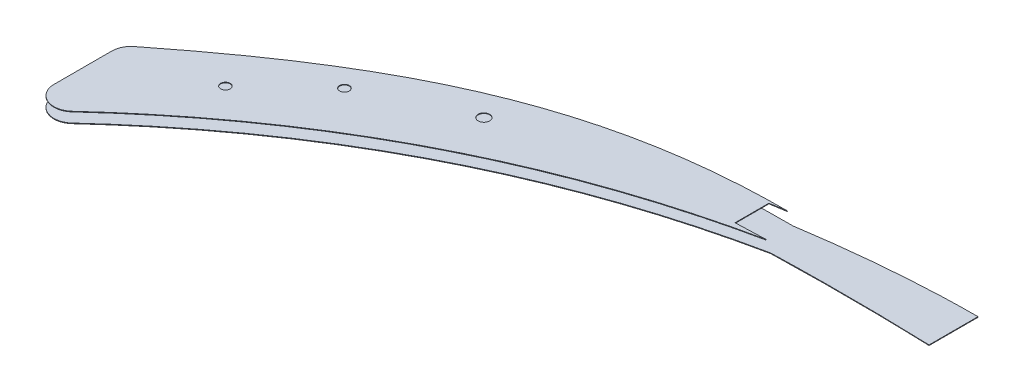
ISO-10303-21;
HEADER;
FILE_DESCRIPTION(('STEP AP214'),'2;1');
FILE_NAME('part.step','',(''),(''),'','','');
FILE_SCHEMA(('AUTOMOTIVE_DESIGN { 1 0 10303 214 1 1 1 1 }'));
ENDSEC;
DATA;
#1=APPLICATION_CONTEXT('core data for automotive mechanical design processes');
#2=APPLICATION_PROTOCOL_DEFINITION('international standard','automotive_design',2000,#1);
#3=PRODUCT_CONTEXT('',#1,'mechanical');
#4=PRODUCT('Part','Part','',(#3));
#5=PRODUCT_RELATED_PRODUCT_CATEGORY('part','',(#4));
#6=PRODUCT_DEFINITION_FORMATION('','',#4);
#7=PRODUCT_DEFINITION_CONTEXT('part definition',#1,'design');
#8=PRODUCT_DEFINITION('design','',#6,#7);
#9=PRODUCT_DEFINITION_SHAPE('','',#8);
#10=(LENGTH_UNIT() NAMED_UNIT(*) SI_UNIT(.MILLI.,.METRE.));
#11=(NAMED_UNIT(*) PLANE_ANGLE_UNIT() SI_UNIT($,.RADIAN.));
#12=(NAMED_UNIT(*) SI_UNIT($,.STERADIAN.) SOLID_ANGLE_UNIT());
#13=UNCERTAINTY_MEASURE_WITH_UNIT(LENGTH_MEASURE(1.E-05),#10,'distance_accuracy_value','');
#14=(GEOMETRIC_REPRESENTATION_CONTEXT(3) GLOBAL_UNCERTAINTY_ASSIGNED_CONTEXT((#13)) GLOBAL_UNIT_ASSIGNED_CONTEXT((#10,
#11,#12)) REPRESENTATION_CONTEXT('',''));
#15=CARTESIAN_POINT('',(0.,0.,0.));
#16=DIRECTION('',(0.,0.,1.));
#17=DIRECTION('',(1.,0.,0.));
#18=AXIS2_PLACEMENT_3D('',#15,#16,#17);
#19=CARTESIAN_POINT('',(-399.451682503824,300.3,386.496425626492));
#20=CARTESIAN_POINT('',(-331.649658003381,300.3,324.043622454853));
#21=CARTESIAN_POINT('',(-251.845093079777,300.3,282.915553356741));
#22=CARTESIAN_POINT('',(-161.60969154118,300.3,263.964054369405));
#23=B_SPLINE_CURVE_WITH_KNOTS('',3,(#19,#20,#21,#22),.UNSPECIFIED.,.F.,.F.,(4,4),(0.,
0.857945261881802),.UNSPECIFIED.);
#24=DIRECTION('',(0.,-1.,0.));
#25=VECTOR('',#24,1.);
#26=SURFACE_OF_LINEAR_EXTRUSION('',#23,#25);
#27=CARTESIAN_POINT('',(-399.451682503824,300.,386.496425626492));
#28=CARTESIAN_POINT('',(-331.649658003381,300.,324.043622454853));
#29=CARTESIAN_POINT('',(-251.845093079777,300.,282.915553356741));
#30=CARTESIAN_POINT('',(-161.60969154118,300.,263.964054369405));
#31=B_SPLINE_CURVE_WITH_KNOTS('',3,(#27,#28,#29,#30),.UNSPECIFIED.,.F.,.F.,(4,4),(0.,
0.857945261881802),.UNSPECIFIED.);
#32=CARTESIAN_POINT('',(-399.451682503824,300.,386.496425626493));
#33=VERTEX_POINT('',#32);
#34=CARTESIAN_POINT('',(-161.609691541186,300.,263.964054369406));
#35=VERTEX_POINT('',#34);
#36=EDGE_CURVE('E254',#33,#35,#31,.T.);
#37=ORIENTED_EDGE('',*,*,#36,.T.);
#38=DIRECTION('',(0.,-1.,0.));
#39=VECTOR('',#38,1.);
#40=CARTESIAN_POINT('',(-161.609691541186,300.3,263.964054369406));
#41=LINE('',#40,#39);
#42=CARTESIAN_POINT('',(-161.609691541186,300.3,263.964054369406));
#43=VERTEX_POINT('',#42);
#44=EDGE_CURVE('E12',#43,#35,#41,.T.);
#45=ORIENTED_EDGE('',*,*,#44,.F.);
#46=CARTESIAN_POINT('',(-161.60969154118,300.3,263.964054369405));
#47=CARTESIAN_POINT('',(-251.845093079777,300.3,282.915553356741));
#48=CARTESIAN_POINT('',(-331.649658003381,300.3,324.043622454853));
#49=CARTESIAN_POINT('',(-399.451682503824,300.3,386.496425626492));
#50=B_SPLINE_CURVE_WITH_KNOTS('',3,(#46,#47,#48,#49),.UNSPECIFIED.,.F.,.F.,(4,4),(0.,
0.857945261881802),.UNSPECIFIED.);
#51=CARTESIAN_POINT('',(-399.451682503824,300.3,386.496425626493));
#52=VERTEX_POINT('',#51);
#53=EDGE_CURVE('E241',#52,#43,#50,.F.);
#54=ORIENTED_EDGE('',*,*,#53,.F.);
#55=DIRECTION('',(0.,-1.,0.));
#56=VECTOR('',#55,1.);
#57=CARTESIAN_POINT('',(-399.451682503824,300.3,386.496425626493));
#58=LINE('',#57,#56);
#59=EDGE_CURVE('E143',#52,#33,#58,.T.);
#60=ORIENTED_EDGE('',*,*,#59,.T.);
#61=EDGE_LOOP('',(#37,#45,#54,#60));
#62=FACE_BOUND('',#61,.T.);
#63=ADVANCED_FACE('F45',(#62),#26,.F.);
#64=CARTESIAN_POINT('',(-161.609691541186,300.3,263.964054369406));
#65=CARTESIAN_POINT('',(-163.461784935838,300.3,264.018551283324));
#66=CARTESIAN_POINT('',(-167.684740985381,300.3,264.151245151058));
#67=CARTESIAN_POINT('',(-172.876910079493,300.3,264.337762118416));
#68=CARTESIAN_POINT('',(-176.217014144586,300.3,264.469751133429));
#69=CARTESIAN_POINT('',(-177.187477809245,300.3,264.509119585318));
#70=B_SPLINE_CURVE_WITH_KNOTS('',3,(#64,#65,#66,#67,#68,#69),.UNSPECIFIED.,.F.,.F.,(4,1,1,4),
(0.455950291136743,0.480354949034344,0.511604949034344,0.524404657897601),.UNSPECIFIED.);
#71=DIRECTION('',(0.,-1.,0.));
#72=VECTOR('',#71,1.);
#73=SURFACE_OF_LINEAR_EXTRUSION('',#70,#72);
#74=CARTESIAN_POINT('',(-161.609691541186,300.,263.964054369406));
#75=CARTESIAN_POINT('',(-163.461784935838,300.,264.018551283324));
#76=CARTESIAN_POINT('',(-167.684740985381,300.,264.151245151058));
#77=CARTESIAN_POINT('',(-172.876910079493,300.,264.337762118416));
#78=CARTESIAN_POINT('',(-176.217014144586,300.,264.469751133429));
#79=CARTESIAN_POINT('',(-177.187477809245,300.,264.509119585318));
#80=B_SPLINE_CURVE_WITH_KNOTS('',3,(#74,#75,#76,#77,#78,#79),.UNSPECIFIED.,.F.,.F.,(4,1,1,4),
(0.455950291136743,0.480354949034344,0.511604949034344,0.524404657897601),.UNSPECIFIED.);
#81=CARTESIAN_POINT('',(-177.187477809245,300.,264.509119585318));
#82=VERTEX_POINT('',#81);
#83=EDGE_CURVE('E294',#35,#82,#80,.T.);
#84=ORIENTED_EDGE('',*,*,#83,.T.);
#85=DIRECTION('',(0.,-1.,0.));
#86=VECTOR('',#85,1.);
#87=CARTESIAN_POINT('',(-177.187477809245,300.3,264.509119585318));
#88=LINE('',#87,#86);
#89=CARTESIAN_POINT('',(-177.187477809245,300.3,264.509119585318));
#90=VERTEX_POINT('',#89);
#91=EDGE_CURVE('E56',#90,#82,#88,.T.);
#92=ORIENTED_EDGE('',*,*,#91,.F.);
#93=CARTESIAN_POINT('',(-177.187477809245,300.3,264.509119585318));
#94=CARTESIAN_POINT('',(-176.217014144586,300.3,264.469751133429));
#95=CARTESIAN_POINT('',(-172.876910079493,300.3,264.337762118416));
#96=CARTESIAN_POINT('',(-167.684740985381,300.3,264.151245151058));
#97=CARTESIAN_POINT('',(-163.461784935838,300.3,264.018551283324));
#98=CARTESIAN_POINT('',(-161.609691541186,300.3,263.964054369406));
#99=B_SPLINE_CURVE_WITH_KNOTS('',3,(#93,#94,#95,#96,#97,#98),.UNSPECIFIED.,.F.,.F.,(4,1,1,4),
(0.455950291136743,0.46875,0.5,0.524404657897601),.UNSPECIFIED.);
#100=EDGE_CURVE('E108',#43,#90,#99,.F.);
#101=ORIENTED_EDGE('',*,*,#100,.F.);
#102=ORIENTED_EDGE('',*,*,#44,.T.);
#103=EDGE_LOOP('',(#84,#92,#101,#102));
#104=FACE_BOUND('',#103,.T.);
#105=ADVANCED_FACE('F195',(#104),#73,.F.);
#106=CARTESIAN_POINT('',(-177.187477809245,300.3,264.509119585318));
#107=DIRECTION('',(-1.,0.,0.));
#108=DIRECTION('',(0.,0.,1.));
#109=AXIS2_PLACEMENT_3D('',#106,#107,#108);
#110=PLANE('',#109);
#111=DIRECTION('',(0.,0.,-1.));
#112=VECTOR('',#111,1.);
#113=CARTESIAN_POINT('',(-177.187477809245,300.,264.509119585318));
#114=LINE('',#113,#112);
#115=CARTESIAN_POINT('',(-177.187477809245,300.,246.945846167666));
#116=VERTEX_POINT('',#115);
#117=EDGE_CURVE('E291',#82,#116,#114,.T.);
#118=ORIENTED_EDGE('',*,*,#117,.T.);
#119=DIRECTION('',(0.,-1.,0.));
#120=VECTOR('',#119,1.);
#121=CARTESIAN_POINT('',(-177.187477809245,300.3,246.945846167666));
#122=LINE('',#121,#120);
#123=CARTESIAN_POINT('',(-177.187477809245,300.3,246.945846167666));
#124=VERTEX_POINT('',#123);
#125=EDGE_CURVE('E153',#124,#116,#122,.T.);
#126=ORIENTED_EDGE('',*,*,#125,.F.);
#127=DIRECTION('',(0.,0.,-1.));
#128=VECTOR('',#127,1.);
#129=CARTESIAN_POINT('',(-177.187477809245,300.3,264.509119585318));
#130=LINE('',#129,#128);
#131=EDGE_CURVE('E317',#90,#124,#130,.T.);
#132=ORIENTED_EDGE('',*,*,#131,.F.);
#133=ORIENTED_EDGE('',*,*,#91,.T.);
#134=EDGE_LOOP('',(#118,#126,#132,#133));
#135=FACE_BOUND('',#134,.T.);
#136=ADVANCED_FACE('F204',(#135),#110,.F.);
#137=CARTESIAN_POINT('',(-62.2203477872149,300.3,937.449704542469));
#138=DIRECTION('',(0.,-1.,0.));
#139=DIRECTION('',(0.,0.,-1.));
#140=AXIS2_PLACEMENT_3D('',#137,#138,#139);
#141=CYLINDRICAL_SURFACE('',#140,700.00929952108);
#142=CARTESIAN_POINT('',(-62.2203477872149,300.,937.449704542469));
#143=DIRECTION('',(0.,-1.,0.));
#144=DIRECTION('',(0.,0.,1.));
#145=AXIS2_PLACEMENT_3D('',#142,#143,#144);
#146=CIRCLE('',#145,700.00929952108);
#147=CARTESIAN_POINT('',(-168.766510620738,300.,245.596443654407));
#148=VERTEX_POINT('',#147);
#149=EDGE_CURVE('E293',#116,#148,#146,.T.);
#150=ORIENTED_EDGE('',*,*,#149,.T.);
#151=DIRECTION('',(0.,-1.,0.));
#152=VECTOR('',#151,1.);
#153=CARTESIAN_POINT('',(-168.766510620738,300.3,245.596443654407));
#154=LINE('',#153,#152);
#155=CARTESIAN_POINT('',(-168.766510620738,300.3,245.596443654407));
#156=VERTEX_POINT('',#155);
#157=EDGE_CURVE('E155',#156,#148,#154,.T.);
#158=ORIENTED_EDGE('',*,*,#157,.F.);
#159=CARTESIAN_POINT('',(-62.2203477872149,300.3,937.449704542469));
#160=DIRECTION('',(0.,-1.,0.));
#161=DIRECTION('',(0.,0.,1.));
#162=AXIS2_PLACEMENT_3D('',#159,#160,#161);
#163=CIRCLE('',#162,700.00929952108);
#164=EDGE_CURVE('E319',#124,#156,#163,.T.);
#165=ORIENTED_EDGE('',*,*,#164,.F.);
#166=ORIENTED_EDGE('',*,*,#125,.T.);
#167=EDGE_LOOP('',(#150,#158,#165,#166));
#168=FACE_BOUND('',#167,.T.);
#169=ADVANCED_FACE('F361',(#168),#141,.F.);
#170=CARTESIAN_POINT('',(-168.766510620738,300.3,245.596443654407));
#171=CARTESIAN_POINT('',(-269.905820359368,300.3,245.400566452578));
#172=CARTESIAN_POINT('',(-338.225722808998,300.3,282.722388214947));
#173=CARTESIAN_POINT('',(-412.421480502429,300.3,341.273256936095));
#174=B_SPLINE_CURVE_WITH_KNOTS('',3,(#170,#171,#172,#173),.UNSPECIFIED.,.F.,.F.,(4,4),
(0.0849051691132969,0.984590409608373),.UNSPECIFIED.);
#175=DIRECTION('',(0.,-1.,0.));
#176=VECTOR('',#175,1.);
#177=SURFACE_OF_LINEAR_EXTRUSION('',#174,#176);
#178=CARTESIAN_POINT('',(-168.766510620738,300.,245.596443654407));
#179=CARTESIAN_POINT('',(-269.905820359368,300.,245.400566452578));
#180=CARTESIAN_POINT('',(-338.225722808998,300.,282.722388214947));
#181=CARTESIAN_POINT('',(-412.421480502429,300.,341.273256936095));
#182=B_SPLINE_CURVE_WITH_KNOTS('',3,(#178,#179,#180,#181),.UNSPECIFIED.,.F.,.F.,(4,4),
(0.0849051691132969,0.984590409608373),.UNSPECIFIED.);
#183=CARTESIAN_POINT('',(-412.421480502429,300.,341.273256936095));
#184=VERTEX_POINT('',#183);
#185=EDGE_CURVE('E328',#148,#184,#182,.T.);
#186=ORIENTED_EDGE('',*,*,#185,.T.);
#187=DIRECTION('',(0.,-1.,0.));
#188=VECTOR('',#187,1.);
#189=CARTESIAN_POINT('',(-412.421480502429,300.3,341.273256936095));
#190=LINE('',#189,#188);
#191=CARTESIAN_POINT('',(-412.421480502429,300.3,341.273256936095));
#192=VERTEX_POINT('',#191);
#193=EDGE_CURVE('E138',#192,#184,#190,.T.);
#194=ORIENTED_EDGE('',*,*,#193,.F.);
#195=CARTESIAN_POINT('',(-412.421480502429,300.3,341.273256936095));
#196=CARTESIAN_POINT('',(-338.225722808998,300.3,282.722388214947));
#197=CARTESIAN_POINT('',(-269.905820359368,300.3,245.400566452578));
#198=CARTESIAN_POINT('',(-168.766510620738,300.3,245.596443654407));
#199=B_SPLINE_CURVE_WITH_KNOTS('',3,(#195,#196,#197,#198),.UNSPECIFIED.,.F.,.F.,(4,4),
(0.0849051691132969,0.984590409608373),.UNSPECIFIED.);
#200=EDGE_CURVE('E128',#156,#192,#199,.F.);
#201=ORIENTED_EDGE('',*,*,#200,.F.);
#202=ORIENTED_EDGE('',*,*,#157,.T.);
#203=EDGE_LOOP('',(#186,#194,#201,#202));
#204=FACE_BOUND('',#203,.T.);
#205=ADVANCED_FACE('F352',(#204),#177,.F.);
#206=CARTESIAN_POINT('',(-406.226649581238,300.3,349.123356926404));
#207=DIRECTION('',(0.,-1.,0.));
#208=DIRECTION('',(0.,0.,-1.));
#209=AXIS2_PLACEMENT_3D('',#206,#207,#208);
#210=CYLINDRICAL_SURFACE('',#209,9.99999999999995);
#211=CARTESIAN_POINT('',(-406.226649581238,300.,349.123356926404));
#212=DIRECTION('',(0.,1.,0.));
#213=DIRECTION('',(0.,0.,1.));
#214=AXIS2_PLACEMENT_3D('',#211,#212,#213);
#215=CIRCLE('',#214,9.99999999999995);
#216=CARTESIAN_POINT('',(-416.226649581238,300.,349.123356926403));
#217=VERTEX_POINT('',#216);
#218=EDGE_CURVE('E137',#184,#217,#215,.T.);
#219=ORIENTED_EDGE('',*,*,#218,.T.);
#220=DIRECTION('',(0.,-1.,0.));
#221=VECTOR('',#220,1.);
#222=CARTESIAN_POINT('',(-416.226649581238,300.3,349.123356926403));
#223=LINE('',#222,#221);
#224=CARTESIAN_POINT('',(-416.226649581238,300.3,349.123356926403));
#225=VERTEX_POINT('',#224);
#226=EDGE_CURVE('E134',#225,#217,#223,.T.);
#227=ORIENTED_EDGE('',*,*,#226,.F.);
#228=CARTESIAN_POINT('',(-406.226649581238,300.3,349.123356926404));
#229=DIRECTION('',(0.,1.,0.));
#230=DIRECTION('',(0.,0.,1.));
#231=AXIS2_PLACEMENT_3D('',#228,#229,#230);
#232=CIRCLE('',#231,9.99999999999995);
#233=EDGE_CURVE('E122',#192,#225,#232,.T.);
#234=ORIENTED_EDGE('',*,*,#233,.F.);
#235=ORIENTED_EDGE('',*,*,#193,.T.);
#236=EDGE_LOOP('',(#219,#227,#234,#235));
#237=FACE_BOUND('',#236,.T.);
#238=ADVANCED_FACE('F135',(#237),#210,.T.);
#239=CARTESIAN_POINT('',(-416.226649581238,300.3,349.123356926403));
#240=DIRECTION('',(1.,0.,0.));
#241=DIRECTION('',(0.,0.,-1.));
#242=AXIS2_PLACEMENT_3D('',#239,#240,#241);
#243=PLANE('',#242);
#244=DIRECTION('',(0.,0.,1.));
#245=VECTOR('',#244,1.);
#246=CARTESIAN_POINT('',(-416.226649581238,300.,349.123356926403));
#247=LINE('',#246,#245);
#248=CARTESIAN_POINT('',(-416.226649581238,300.,379.14116756848));
#249=VERTEX_POINT('',#248);
#250=EDGE_CURVE('E94',#217,#249,#247,.T.);
#251=ORIENTED_EDGE('',*,*,#250,.T.);
#252=DIRECTION('',(0.,-1.,0.));
#253=VECTOR('',#252,1.);
#254=CARTESIAN_POINT('',(-416.226649581238,300.3,379.14116756848));
#255=LINE('',#254,#253);
#256=CARTESIAN_POINT('',(-416.226649581238,300.3,379.14116756848));
#257=VERTEX_POINT('',#256);
#258=EDGE_CURVE('E139',#257,#249,#255,.T.);
#259=ORIENTED_EDGE('',*,*,#258,.F.);
#260=DIRECTION('',(0.,0.,1.));
#261=VECTOR('',#260,1.);
#262=CARTESIAN_POINT('',(-416.226649581238,300.3,349.123356926403));
#263=LINE('',#262,#261);
#264=EDGE_CURVE('E126',#225,#257,#263,.T.);
#265=ORIENTED_EDGE('',*,*,#264,.F.);
#266=ORIENTED_EDGE('',*,*,#226,.T.);
#267=EDGE_LOOP('',(#251,#259,#265,#266));
#268=FACE_BOUND('',#267,.T.);
#269=ADVANCED_FACE('F141',(#268),#243,.F.);
#270=CARTESIAN_POINT('',(-406.226649581238,300.3,379.14116756848));
#271=DIRECTION('',(0.,-1.,0.));
#272=DIRECTION('',(0.,0.,-1.));
#273=AXIS2_PLACEMENT_3D('',#270,#271,#272);
#274=CYLINDRICAL_SURFACE('',#273,10.);
#275=CARTESIAN_POINT('',(-406.226649581238,300.,379.14116756848));
#276=DIRECTION('',(0.,1.,0.));
#277=DIRECTION('',(0.,0.,1.));
#278=AXIS2_PLACEMENT_3D('',#275,#276,#277);
#279=CIRCLE('',#278,10.);
#280=EDGE_CURVE('E100',#249,#33,#279,.T.);
#281=ORIENTED_EDGE('',*,*,#280,.T.);
#282=ORIENTED_EDGE('',*,*,#59,.F.);
#283=CARTESIAN_POINT('',(-406.226649581238,300.3,379.14116756848));
#284=DIRECTION('',(0.,1.,0.));
#285=DIRECTION('',(0.,0.,1.));
#286=AXIS2_PLACEMENT_3D('',#283,#284,#285);
#287=CIRCLE('',#286,10.);
#288=EDGE_CURVE('E65',#257,#52,#287,.T.);
#289=ORIENTED_EDGE('',*,*,#288,.F.);
#290=ORIENTED_EDGE('',*,*,#258,.T.);
#291=EDGE_LOOP('',(#281,#282,#289,#290));
#292=FACE_BOUND('',#291,.T.);
#293=ADVANCED_FACE('F172',(#292),#274,.T.);
#294=CARTESIAN_POINT('',(-288.94320341181,300.3,308.917250928835));
#295=DIRECTION('',(0.,1.,0.));
#296=DIRECTION('',(0.,0.,1.));
#297=AXIS2_PLACEMENT_3D('',#294,#295,#296);
#298=PLANE('',#297);
#299=CARTESIAN_POINT('',(-370.956911026411,300.3,335.367132453118));
#300=DIRECTION('',(0.,1.,0.));
#301=DIRECTION('',(0.,0.,1.));
#302=AXIS2_PLACEMENT_3D('',#299,#300,#301);
#303=CIRCLE('',#302,2.50000000000002);
#304=CARTESIAN_POINT('',(-370.956911026411,300.3,337.867132453118));
#305=VERTEX_POINT('',#304);
#306=EDGE_CURVE('E226',#305,#305,#303,.T.);
#307=ORIENTED_EDGE('',*,*,#306,.F.);
#308=EDGE_LOOP('',(#307));
#309=FACE_BOUND('',#308,.T.);
#310=CARTESIAN_POINT('',(-339.082998520851,300.3,305.429754445409));
#311=DIRECTION('',(0.,1.,0.));
#312=DIRECTION('',(0.,0.,1.));
#313=AXIS2_PLACEMENT_3D('',#310,#311,#312);
#314=CIRCLE('',#313,2.50000000000002);
#315=CARTESIAN_POINT('',(-339.082998520851,300.3,307.929754445409));
#316=VERTEX_POINT('',#315);
#317=EDGE_CURVE('E223',#316,#316,#314,.T.);
#318=ORIENTED_EDGE('',*,*,#317,.F.);
#319=EDGE_LOOP('',(#318));
#320=FACE_BOUND('',#319,.T.);
#321=CARTESIAN_POINT('',(-289.687055909534,300.3,282.424125212571));
#322=DIRECTION('',(0.,1.,0.));
#323=DIRECTION('',(0.,0.,1.));
#324=AXIS2_PLACEMENT_3D('',#321,#322,#323);
#325=CIRCLE('',#324,2.99999999999999);
#326=CARTESIAN_POINT('',(-289.687055909534,300.3,285.424125212571));
#327=VERTEX_POINT('',#326);
#328=EDGE_CURVE('E217',#327,#327,#325,.T.);
#329=ORIENTED_EDGE('',*,*,#328,.F.);
#330=EDGE_LOOP('',(#329));
#331=FACE_BOUND('',#330,.T.);
#332=ORIENTED_EDGE('',*,*,#53,.T.);
#333=ORIENTED_EDGE('',*,*,#100,.T.);
#334=ORIENTED_EDGE('',*,*,#131,.T.);
#335=ORIENTED_EDGE('',*,*,#164,.T.);
#336=ORIENTED_EDGE('',*,*,#200,.T.);
#337=ORIENTED_EDGE('',*,*,#233,.T.);
#338=ORIENTED_EDGE('',*,*,#264,.T.);
#339=ORIENTED_EDGE('',*,*,#288,.T.);
#340=EDGE_LOOP('',(#332,#333,#334,#335,#336,#337,#338,#339));
#341=FACE_BOUND('',#340,.T.);
#342=ADVANCED_FACE('F124',(#309,#320,#331,#341),#298,.T.);
#343=CARTESIAN_POINT('',(-288.94320341181,300.,308.917250928835));
#344=DIRECTION('',(0.,1.,0.));
#345=DIRECTION('',(0.,0.,1.));
#346=AXIS2_PLACEMENT_3D('',#343,#344,#345);
#347=PLANE('',#346);
#348=CARTESIAN_POINT('',(-370.956911026411,300.,335.367132453118));
#349=DIRECTION('',(0.,1.,0.));
#350=DIRECTION('',(0.,0.,1.));
#351=AXIS2_PLACEMENT_3D('',#348,#349,#350);
#352=CIRCLE('',#351,2.50000000000002);
#353=CARTESIAN_POINT('',(-370.956911026411,300.,337.867132453118));
#354=VERTEX_POINT('',#353);
#355=EDGE_CURVE('E50',#354,#354,#352,.T.);
#356=ORIENTED_EDGE('',*,*,#355,.T.);
#357=EDGE_LOOP('',(#356));
#358=FACE_BOUND('',#357,.T.);
#359=CARTESIAN_POINT('',(-339.082998520851,300.,305.429754445409));
#360=DIRECTION('',(0.,1.,0.));
#361=DIRECTION('',(0.,0.,1.));
#362=AXIS2_PLACEMENT_3D('',#359,#360,#361);
#363=CIRCLE('',#362,2.50000000000002);
#364=CARTESIAN_POINT('',(-339.082998520851,300.,307.929754445409));
#365=VERTEX_POINT('',#364);
#366=EDGE_CURVE('E232',#365,#365,#363,.T.);
#367=ORIENTED_EDGE('',*,*,#366,.T.);
#368=EDGE_LOOP('',(#367));
#369=FACE_BOUND('',#368,.T.);
#370=CARTESIAN_POINT('',(-289.687055909534,300.,282.424125212571));
#371=DIRECTION('',(0.,1.,0.));
#372=DIRECTION('',(0.,0.,1.));
#373=AXIS2_PLACEMENT_3D('',#370,#371,#372);
#374=CIRCLE('',#373,2.99999999999999);
#375=CARTESIAN_POINT('',(-289.687055909534,300.,285.424125212571));
#376=VERTEX_POINT('',#375);
#377=EDGE_CURVE('E228',#376,#376,#374,.T.);
#378=ORIENTED_EDGE('',*,*,#377,.T.);
#379=EDGE_LOOP('',(#378));
#380=FACE_BOUND('',#379,.T.);
#381=ORIENTED_EDGE('',*,*,#36,.F.);
#382=ORIENTED_EDGE('',*,*,#280,.F.);
#383=ORIENTED_EDGE('',*,*,#250,.F.);
#384=ORIENTED_EDGE('',*,*,#218,.F.);
#385=ORIENTED_EDGE('',*,*,#185,.F.);
#386=ORIENTED_EDGE('',*,*,#149,.F.);
#387=ORIENTED_EDGE('',*,*,#117,.F.);
#388=ORIENTED_EDGE('',*,*,#83,.F.);
#389=EDGE_LOOP('',(#381,#382,#383,#384,#385,#386,#387,#388));
#390=FACE_BOUND('',#389,.T.);
#391=ADVANCED_FACE('F171',(#358,#369,#380,#390),#347,.F.);
#392=CARTESIAN_POINT('',(-289.687055909534,288.3,282.424125212571));
#393=DIRECTION('',(0.,1.,0.));
#394=DIRECTION('',(0.,0.,1.));
#395=AXIS2_PLACEMENT_3D('',#392,#393,#394);
#396=CYLINDRICAL_SURFACE('',#395,2.99999999999999);
#397=ORIENTED_EDGE('',*,*,#328,.T.);
#398=EDGE_LOOP('',(#397));
#399=FACE_BOUND('',#398,.T.);
#400=ORIENTED_EDGE('',*,*,#377,.F.);
#401=EDGE_LOOP('',(#400));
#402=FACE_BOUND('',#401,.T.);
#403=ADVANCED_FACE('F174',(#399,#402),#396,.F.);
#404=CARTESIAN_POINT('',(-339.082998520851,288.3,305.429754445409));
#405=DIRECTION('',(0.,1.,0.));
#406=DIRECTION('',(0.,0.,1.));
#407=AXIS2_PLACEMENT_3D('',#404,#405,#406);
#408=CYLINDRICAL_SURFACE('',#407,2.50000000000002);
#409=ORIENTED_EDGE('',*,*,#317,.T.);
#410=EDGE_LOOP('',(#409));
#411=FACE_BOUND('',#410,.T.);
#412=ORIENTED_EDGE('',*,*,#366,.F.);
#413=EDGE_LOOP('',(#412));
#414=FACE_BOUND('',#413,.T.);
#415=ADVANCED_FACE('F452',(#411,#414),#408,.F.);
#416=CARTESIAN_POINT('',(-370.956911026411,288.3,335.367132453118));
#417=DIRECTION('',(0.,1.,0.));
#418=DIRECTION('',(0.,0.,1.));
#419=AXIS2_PLACEMENT_3D('',#416,#417,#418);
#420=CYLINDRICAL_SURFACE('',#419,2.50000000000002);
#421=ORIENTED_EDGE('',*,*,#306,.T.);
#422=EDGE_LOOP('',(#421));
#423=FACE_BOUND('',#422,.T.);
#424=ORIENTED_EDGE('',*,*,#355,.F.);
#425=EDGE_LOOP('',(#424));
#426=FACE_BOUND('',#425,.T.);
#427=ADVANCED_FACE('F461',(#423,#426),#420,.F.);
#428=CLOSED_SHELL('',(#63,#105,#136,#169,#205,#238,#269,#293,#342,#391,#403,#415,#427));
#429=MANIFOLD_SOLID_BREP('B2',#428);
#430=CARTESIAN_POINT('',(-412.421480502429,294.7,341.273256936095));
#431=CARTESIAN_POINT('',(-337.562441747407,294.7,282.19896634327));
#432=CARTESIAN_POINT('',(-268.684783511191,294.7,244.734978020227));
#433=CARTESIAN_POINT('',(-166.046176884714,294.7,245.610703349975));
#434=B_SPLINE_CURVE_WITH_KNOTS('',3,(#430,#431,#432,#433),.UNSPECIFIED.,.F.,.F.,(4,4),
(0.0768623348601792,0.984590409608373),.UNSPECIFIED.);
#435=DIRECTION('',(0.,1.,0.));
#436=VECTOR('',#435,1.);
#437=SURFACE_OF_LINEAR_EXTRUSION('',#434,#436);
#438=CARTESIAN_POINT('',(-412.421480502429,295.,341.273256936095));
#439=CARTESIAN_POINT('',(-337.562441747407,295.,282.19896634327));
#440=CARTESIAN_POINT('',(-268.684783511191,295.,244.734978020227));
#441=CARTESIAN_POINT('',(-166.046176884714,295.,245.610703349975));
#442=B_SPLINE_CURVE_WITH_KNOTS('',3,(#438,#439,#440,#441),.UNSPECIFIED.,.F.,.F.,(4,4),
(0.0768623348601792,0.984590409608373),.UNSPECIFIED.);
#443=CARTESIAN_POINT('',(-412.421480502429,295.,341.273256936095));
#444=VERTEX_POINT('',#443);
#445=CARTESIAN_POINT('',(-166.046176884714,295.,245.610703349975));
#446=VERTEX_POINT('',#445);
#447=EDGE_CURVE('E734',#444,#446,#442,.T.);
#448=ORIENTED_EDGE('',*,*,#447,.T.);
#449=DIRECTION('',(0.,1.,0.));
#450=VECTOR('',#449,1.);
#451=CARTESIAN_POINT('',(-166.046176884714,294.7,245.610703349975));
#452=LINE('',#451,#450);
#453=CARTESIAN_POINT('',(-166.046176884714,294.7,245.610703349975));
#454=VERTEX_POINT('',#453);
#455=EDGE_CURVE('E43',#454,#446,#452,.T.);
#456=ORIENTED_EDGE('',*,*,#455,.F.);
#457=CARTESIAN_POINT('',(-412.421480502429,294.7,341.273256936095));
#458=VERTEX_POINT('',#457);
#459=EDGE_CURVE('E601',#458,#454,#434,.T.);
#460=ORIENTED_EDGE('',*,*,#459,.F.);
#461=DIRECTION('',(0.,1.,0.));
#462=VECTOR('',#461,1.);
#463=CARTESIAN_POINT('',(-412.421480502429,294.7,341.273256936095));
#464=LINE('',#463,#462);
#465=EDGE_CURVE('E593',#458,#444,#464,.T.);
#466=ORIENTED_EDGE('',*,*,#465,.T.);
#467=EDGE_LOOP('',(#448,#456,#460,#466));
#468=FACE_BOUND('',#467,.T.);
#469=ADVANCED_FACE('F497',(#468),#437,.F.);
#470=CARTESIAN_POINT('',(-166.046176884714,294.7,245.610703349975));
#471=CARTESIAN_POINT('',(-158.691588185936,294.7,244.479612696359));
#472=CARTESIAN_POINT('',(-151.319796635798,294.7,243.468209687689));
#473=CARTESIAN_POINT('',(-136.557675167849,294.7,241.699121011541));
#474=CARTESIAN_POINT('',(-129.16508875455,294.7,240.940959884745));
#475=CARTESIAN_POINT('',(-114.354878372138,294.7,239.699183418636));
#476=CARTESIAN_POINT('',(-106.937301857712,294.7,239.215047721649));
#477=CARTESIAN_POINT('',(-95.7901021433856,294.7,238.717306802063));
#478=CARTESIAN_POINT('',(-92.0700558776784,294.7,238.589825858461));
#479=CARTESIAN_POINT('',(-84.6298578500282,294.7,238.417469405935));
#480=CARTESIAN_POINT('',(-80.9090479891768,294.7,238.372473535805));
#481=CARTESIAN_POINT('',(-77.187477809136,294.7,238.371526152161));
#482=B_SPLINE_CURVE_WITH_KNOTS('',3,(#470,#471,#472,#473,#474,#475,#476,#477,#478,#479,#480,
#481),.UNSPECIFIED.,.F.,.F.,(4,2,2,2,2,4),(0.,0.25,0.5,0.75,0.875,1.),.UNSPECIFIED.);
#483=DIRECTION('',(0.,1.,0.));
#484=VECTOR('',#483,1.);
#485=SURFACE_OF_LINEAR_EXTRUSION('',#482,#484);
#486=CARTESIAN_POINT('',(-166.046176884714,295.,245.610703349975));
#487=CARTESIAN_POINT('',(-158.691588185936,295.,244.479612696359));
#488=CARTESIAN_POINT('',(-151.319796635798,295.,243.468209687689));
#489=CARTESIAN_POINT('',(-136.557675167849,295.,241.699121011541));
#490=CARTESIAN_POINT('',(-129.16508875455,295.,240.940959884745));
#491=CARTESIAN_POINT('',(-114.354878372138,295.,239.699183418636));
#492=CARTESIAN_POINT('',(-106.937301857712,295.,239.215047721649));
#493=CARTESIAN_POINT('',(-95.7901021433856,295.,238.717306802063));
#494=CARTESIAN_POINT('',(-92.0700558776784,295.,238.589825858461));
#495=CARTESIAN_POINT('',(-84.6298578500282,295.,238.417469405935));
#496=CARTESIAN_POINT('',(-80.9090479891768,295.,238.372473535805));
#497=CARTESIAN_POINT('',(-77.187477809136,295.,238.371526152161));
#498=B_SPLINE_CURVE_WITH_KNOTS('',3,(#486,#487,#488,#489,#490,#491,#492,#493,#494,#495,#496,
#497),.UNSPECIFIED.,.F.,.F.,(4,2,2,2,2,4),(0.,0.25,0.5,0.75,0.875,1.),.UNSPECIFIED.);
#499=CARTESIAN_POINT('',(-77.187477809136,295.,238.371526152161));
#500=VERTEX_POINT('',#499);
#501=EDGE_CURVE('E717',#446,#500,#498,.T.);
#502=ORIENTED_EDGE('',*,*,#501,.T.);
#503=DIRECTION('',(0.,1.,0.));
#504=VECTOR('',#503,1.);
#505=CARTESIAN_POINT('',(-77.187477809136,294.7,238.371526152161));
#506=LINE('',#505,#504);
#507=CARTESIAN_POINT('',(-77.187477809136,294.7,238.371526152161));
#508=VERTEX_POINT('',#507);
#509=EDGE_CURVE('E507',#508,#500,#506,.T.);
#510=ORIENTED_EDGE('',*,*,#509,.F.);
#511=CARTESIAN_POINT('',(-77.187477809136,294.7,238.371526152161));
#512=CARTESIAN_POINT('',(-80.9090479891768,294.7,238.372473535805));
#513=CARTESIAN_POINT('',(-84.6298578500282,294.7,238.417469405935));
#514=CARTESIAN_POINT('',(-92.0700558776784,294.7,238.589825858461));
#515=CARTESIAN_POINT('',(-95.7901021433856,294.7,238.717306802063));
#516=CARTESIAN_POINT('',(-106.937301857712,294.7,239.215047721649));
#517=CARTESIAN_POINT('',(-114.354878372138,294.7,239.699183418636));
#518=CARTESIAN_POINT('',(-129.16508875455,294.7,240.940959884745));
#519=CARTESIAN_POINT('',(-136.557675167849,294.7,241.699121011541));
#520=CARTESIAN_POINT('',(-151.319796635798,294.7,243.468209687689));
#521=CARTESIAN_POINT('',(-158.691588185936,294.7,244.479612696359));
#522=CARTESIAN_POINT('',(-166.046176884714,294.7,245.610703349975));
#523=B_SPLINE_CURVE_WITH_KNOTS('',3,(#511,#512,#513,#514,#515,#516,#517,#518,#519,#520,#521,
#522),.UNSPECIFIED.,.F.,.F.,(4,2,2,2,2,4),(0.,0.125,0.25,0.5,0.75,1.),.UNSPECIFIED.);
#524=EDGE_CURVE('E559',#454,#508,#523,.F.);
#525=ORIENTED_EDGE('',*,*,#524,.F.);
#526=ORIENTED_EDGE('',*,*,#455,.T.);
#527=EDGE_LOOP('',(#502,#510,#525,#526));
#528=FACE_BOUND('',#527,.T.);
#529=ADVANCED_FACE('F646',(#528),#485,.F.);
#530=CARTESIAN_POINT('',(-77.1874778091361,294.7,238.37152615216));
#531=DIRECTION('',(-1.,0.,0.));
#532=DIRECTION('',(0.,0.,1.));
#533=AXIS2_PLACEMENT_3D('',#530,#531,#532);
#534=PLANE('',#533);
#535=DIRECTION('',(0.,0.,1.));
#536=VECTOR('',#535,1.);
#537=CARTESIAN_POINT('',(-77.1874778091361,295.,238.37152615216));
#538=LINE('',#537,#536);
#539=CARTESIAN_POINT('',(-77.187477809136,295.,263.787467627316));
#540=VERTEX_POINT('',#539);
#541=EDGE_CURVE('E710',#500,#540,#538,.T.);
#542=ORIENTED_EDGE('',*,*,#541,.T.);
#543=DIRECTION('',(0.,1.,0.));
#544=VECTOR('',#543,1.);
#545=CARTESIAN_POINT('',(-77.187477809136,294.7,263.787467627316));
#546=LINE('',#545,#544);
#547=CARTESIAN_POINT('',(-77.187477809136,294.7,263.787467627316));
#548=VERTEX_POINT('',#547);
#549=EDGE_CURVE('E730',#548,#540,#546,.T.);
#550=ORIENTED_EDGE('',*,*,#549,.F.);
#551=DIRECTION('',(0.,0.,1.));
#552=VECTOR('',#551,1.);
#553=CARTESIAN_POINT('',(-77.1874778091361,294.7,238.37152615216));
#554=LINE('',#553,#552);
#555=EDGE_CURVE('E875',#508,#548,#554,.T.);
#556=ORIENTED_EDGE('',*,*,#555,.F.);
#557=ORIENTED_EDGE('',*,*,#509,.T.);
#558=EDGE_LOOP('',(#542,#550,#556,#557));
#559=FACE_BOUND('',#558,.T.);
#560=ADVANCED_FACE('F656',(#559),#534,.F.);
#561=CARTESIAN_POINT('',(-77.187477809136,294.7,263.787467627316));
#562=CARTESIAN_POINT('',(-90.931891453586,294.7,263.302665158087));
#563=CARTESIAN_POINT('',(-104.681952299398,294.7,263.050489589005));
#564=CARTESIAN_POINT('',(-132.179761622917,294.7,262.987125090098));
#565=CARTESIAN_POINT('',(-145.931371491931,294.7,263.172070992793));
#566=CARTESIAN_POINT('',(-159.678350984095,294.7,263.562143642599));
#567=B_SPLINE_CURVE_WITH_KNOTS('',3,(#561,#562,#563,#564,#565,#566),.UNSPECIFIED.,.F.,.F.,(4,2,
4),(0.,0.5,1.),.UNSPECIFIED.);
#568=DIRECTION('',(0.,1.,0.));
#569=VECTOR('',#568,1.);
#570=SURFACE_OF_LINEAR_EXTRUSION('',#567,#569);
#571=CARTESIAN_POINT('',(-77.187477809136,295.,263.787467627316));
#572=CARTESIAN_POINT('',(-90.931891453586,295.,263.302665158087));
#573=CARTESIAN_POINT('',(-104.681952299398,295.,263.050489589005));
#574=CARTESIAN_POINT('',(-132.179761622917,295.,262.987125090098));
#575=CARTESIAN_POINT('',(-145.931371491931,295.,263.172070992793));
#576=CARTESIAN_POINT('',(-159.678350984095,295.,263.562143642599));
#577=B_SPLINE_CURVE_WITH_KNOTS('',3,(#571,#572,#573,#574,#575,#576),.UNSPECIFIED.,.F.,.F.,(4,2,
4),(0.,0.5,1.),.UNSPECIFIED.);
#578=CARTESIAN_POINT('',(-159.678350984095,295.,263.562143642599));
#579=VERTEX_POINT('',#578);
#580=EDGE_CURVE('E706',#540,#579,#577,.T.);
#581=ORIENTED_EDGE('',*,*,#580,.T.);
#582=DIRECTION('',(0.,1.,0.));
#583=VECTOR('',#582,1.);
#584=CARTESIAN_POINT('',(-159.678350984095,294.7,263.562143642599));
#585=LINE('',#584,#583);
#586=CARTESIAN_POINT('',(-159.678350984095,294.7,263.562143642599));
#587=VERTEX_POINT('',#586);
#588=EDGE_CURVE('E605',#587,#579,#585,.T.);
#589=ORIENTED_EDGE('',*,*,#588,.F.);
#590=CARTESIAN_POINT('',(-159.678350984095,294.7,263.562143642599));
#591=CARTESIAN_POINT('',(-145.931371491931,294.7,263.172070992793));
#592=CARTESIAN_POINT('',(-132.179761622917,294.7,262.987125090098));
#593=CARTESIAN_POINT('',(-104.681952299398,294.7,263.050489589005));
#594=CARTESIAN_POINT('',(-90.931891453586,294.7,263.302665158087));
#595=CARTESIAN_POINT('',(-77.187477809136,294.7,263.787467627316));
#596=B_SPLINE_CURVE_WITH_KNOTS('',3,(#590,#591,#592,#593,#594,#595),.UNSPECIFIED.,.F.,.F.,(4,2,
4),(0.,0.5,1.),.UNSPECIFIED.);
#597=EDGE_CURVE('E608',#548,#587,#596,.F.);
#598=ORIENTED_EDGE('',*,*,#597,.F.);
#599=ORIENTED_EDGE('',*,*,#549,.T.);
#600=EDGE_LOOP('',(#581,#589,#598,#599));
#601=FACE_BOUND('',#600,.T.);
#602=ADVANCED_FACE('F679',(#601),#570,.F.);
#603=CARTESIAN_POINT('',(-159.678350984092,294.7,263.562143642598));
#604=CARTESIAN_POINT('',(-250.706696635341,294.7,282.330267513561));
#605=CARTESIAN_POINT('',(-331.166325820129,294.7,323.598422625947));
#606=CARTESIAN_POINT('',(-399.451682503824,294.7,386.496425626492));
#607=B_SPLINE_CURVE_WITH_KNOTS('',3,(#603,#604,#605,#606),.UNSPECIFIED.,.F.,.F.,(4,4),(0.,
0.864061193663942),.UNSPECIFIED.);
#608=DIRECTION('',(0.,1.,0.));
#609=VECTOR('',#608,1.);
#610=SURFACE_OF_LINEAR_EXTRUSION('',#607,#609);
#611=CARTESIAN_POINT('',(-159.678350984092,295.,263.562143642598));
#612=CARTESIAN_POINT('',(-250.706696635341,295.,282.330267513561));
#613=CARTESIAN_POINT('',(-331.166325820129,295.,323.598422625947));
#614=CARTESIAN_POINT('',(-399.451682503824,295.,386.496425626492));
#615=B_SPLINE_CURVE_WITH_KNOTS('',3,(#611,#612,#613,#614),.UNSPECIFIED.,.F.,.F.,(4,4),(0.,
0.864061193663942),.UNSPECIFIED.);
#616=CARTESIAN_POINT('',(-399.451682503824,295.,386.496425626492));
#617=VERTEX_POINT('',#616);
#618=EDGE_CURVE('E598',#579,#617,#615,.T.);
#619=ORIENTED_EDGE('',*,*,#618,.T.);
#620=DIRECTION('',(0.,1.,0.));
#621=VECTOR('',#620,1.);
#622=CARTESIAN_POINT('',(-399.451682503824,294.7,386.496425626492));
#623=LINE('',#622,#621);
#624=CARTESIAN_POINT('',(-399.451682503824,294.7,386.496425626492));
#625=VERTEX_POINT('',#624);
#626=EDGE_CURVE('E588',#625,#617,#623,.T.);
#627=ORIENTED_EDGE('',*,*,#626,.F.);
#628=EDGE_CURVE('E579',#587,#625,#607,.T.);
#629=ORIENTED_EDGE('',*,*,#628,.F.);
#630=ORIENTED_EDGE('',*,*,#588,.T.);
#631=EDGE_LOOP('',(#619,#627,#629,#630));
#632=FACE_BOUND('',#631,.T.);
#633=ADVANCED_FACE('F683',(#632),#610,.F.);
#634=CARTESIAN_POINT('',(-406.226649581238,294.7,379.14116756848));
#635=DIRECTION('',(0.,1.,0.));
#636=DIRECTION('',(0.,0.,1.));
#637=AXIS2_PLACEMENT_3D('',#634,#635,#636);
#638=CYLINDRICAL_SURFACE('',#637,10.);
#639=CARTESIAN_POINT('',(-406.226649581238,295.,379.14116756848));
#640=DIRECTION('',(0.,-1.,0.));
#641=DIRECTION('',(0.,0.,-1.));
#642=AXIS2_PLACEMENT_3D('',#639,#640,#641);
#643=CIRCLE('',#642,10.);
#644=CARTESIAN_POINT('',(-416.226649581238,295.,379.14116756848));
#645=VERTEX_POINT('',#644);
#646=EDGE_CURVE('E587',#617,#645,#643,.T.);
#647=ORIENTED_EDGE('',*,*,#646,.T.);
#648=DIRECTION('',(0.,1.,0.));
#649=VECTOR('',#648,1.);
#650=CARTESIAN_POINT('',(-416.226649581238,294.7,379.14116756848));
#651=LINE('',#650,#649);
#652=CARTESIAN_POINT('',(-416.226649581238,294.7,379.14116756848));
#653=VERTEX_POINT('',#652);
#654=EDGE_CURVE('E584',#653,#645,#651,.T.);
#655=ORIENTED_EDGE('',*,*,#654,.F.);
#656=CARTESIAN_POINT('',(-406.226649581238,294.7,379.14116756848));
#657=DIRECTION('',(0.,-1.,0.));
#658=DIRECTION('',(0.,0.,-1.));
#659=AXIS2_PLACEMENT_3D('',#656,#657,#658);
#660=CIRCLE('',#659,10.);
#661=EDGE_CURVE('E573',#625,#653,#660,.T.);
#662=ORIENTED_EDGE('',*,*,#661,.F.);
#663=ORIENTED_EDGE('',*,*,#626,.T.);
#664=EDGE_LOOP('',(#647,#655,#662,#663));
#665=FACE_BOUND('',#664,.T.);
#666=ADVANCED_FACE('F585',(#665),#638,.T.);
#667=CARTESIAN_POINT('',(-416.226649581238,294.7,379.14116756848));
#668=DIRECTION('',(1.,0.,0.));
#669=DIRECTION('',(0.,0.,-1.));
#670=AXIS2_PLACEMENT_3D('',#667,#668,#669);
#671=PLANE('',#670);
#672=DIRECTION('',(0.,0.,-1.));
#673=VECTOR('',#672,1.);
#674=CARTESIAN_POINT('',(-416.226649581238,295.,379.14116756848));
#675=LINE('',#674,#673);
#676=CARTESIAN_POINT('',(-416.226649581238,295.,349.123356926403));
#677=VERTEX_POINT('',#676);
#678=EDGE_CURVE('E545',#645,#677,#675,.T.);
#679=ORIENTED_EDGE('',*,*,#678,.T.);
#680=DIRECTION('',(0.,1.,0.));
#681=VECTOR('',#680,1.);
#682=CARTESIAN_POINT('',(-416.226649581238,294.7,349.123356926403));
#683=LINE('',#682,#681);
#684=CARTESIAN_POINT('',(-416.226649581238,294.7,349.123356926403));
#685=VERTEX_POINT('',#684);
#686=EDGE_CURVE('E589',#685,#677,#683,.T.);
#687=ORIENTED_EDGE('',*,*,#686,.F.);
#688=DIRECTION('',(0.,0.,-1.));
#689=VECTOR('',#688,1.);
#690=CARTESIAN_POINT('',(-416.226649581238,294.7,379.14116756848));
#691=LINE('',#690,#689);
#692=EDGE_CURVE('E577',#653,#685,#691,.T.);
#693=ORIENTED_EDGE('',*,*,#692,.F.);
#694=ORIENTED_EDGE('',*,*,#654,.T.);
#695=EDGE_LOOP('',(#679,#687,#693,#694));
#696=FACE_BOUND('',#695,.T.);
#697=ADVANCED_FACE('F591',(#696),#671,.F.);
#698=CARTESIAN_POINT('',(-406.226649581238,294.7,349.123356926404));
#699=DIRECTION('',(0.,1.,0.));
#700=DIRECTION('',(0.,0.,1.));
#701=AXIS2_PLACEMENT_3D('',#698,#699,#700);
#702=CYLINDRICAL_SURFACE('',#701,9.99999999999995);
#703=CARTESIAN_POINT('',(-406.226649581238,295.,349.123356926404));
#704=DIRECTION('',(0.,-1.,0.));
#705=DIRECTION('',(0.,0.,-1.));
#706=AXIS2_PLACEMENT_3D('',#703,#704,#705);
#707=CIRCLE('',#706,9.99999999999995);
#708=EDGE_CURVE('E551',#677,#444,#707,.T.);
#709=ORIENTED_EDGE('',*,*,#708,.T.);
#710=ORIENTED_EDGE('',*,*,#465,.F.);
#711=CARTESIAN_POINT('',(-406.226649581238,294.7,349.123356926404));
#712=DIRECTION('',(0.,-1.,0.));
#713=DIRECTION('',(0.,0.,-1.));
#714=AXIS2_PLACEMENT_3D('',#711,#712,#713);
#715=CIRCLE('',#714,9.99999999999995);
#716=EDGE_CURVE('E516',#685,#458,#715,.T.);
#717=ORIENTED_EDGE('',*,*,#716,.F.);
#718=ORIENTED_EDGE('',*,*,#686,.T.);
#719=EDGE_LOOP('',(#709,#710,#717,#718));
#720=FACE_BOUND('',#719,.T.);
#721=ADVANCED_FACE('F625',(#720),#702,.T.);
#722=CARTESIAN_POINT('',(-299.651166645367,294.7,270.96072417207));
#723=DIRECTION('',(0.,1.,0.));
#724=DIRECTION('',(0.,0.,1.));
#725=AXIS2_PLACEMENT_3D('',#722,#723,#724);
#726=PLANE('',#725);
#727=CARTESIAN_POINT('',(-370.956911026411,294.7,335.367132453118));
#728=DIRECTION('',(0.,1.,0.));
#729=DIRECTION('',(0.,0.,1.));
#730=AXIS2_PLACEMENT_3D('',#727,#728,#729);
#731=CIRCLE('',#730,2.50000000000002);
#732=CARTESIAN_POINT('',(-370.956911026411,294.7,337.867132453118));
#733=VERTEX_POINT('',#732);
#734=EDGE_CURVE('E738',#733,#733,#731,.T.);
#735=ORIENTED_EDGE('',*,*,#734,.T.);
#736=EDGE_LOOP('',(#735));
#737=FACE_BOUND('',#736,.T.);
#738=CARTESIAN_POINT('',(-339.082998520851,294.7,305.429754445409));
#739=DIRECTION('',(0.,1.,0.));
#740=DIRECTION('',(0.,0.,1.));
#741=AXIS2_PLACEMENT_3D('',#738,#739,#740);
#742=CIRCLE('',#741,2.50000000000002);
#743=CARTESIAN_POINT('',(-339.082998520851,294.7,307.929754445409));
#744=VERTEX_POINT('',#743);
#745=EDGE_CURVE('E757',#744,#744,#742,.T.);
#746=ORIENTED_EDGE('',*,*,#745,.T.);
#747=EDGE_LOOP('',(#746));
#748=FACE_BOUND('',#747,.T.);
#749=CARTESIAN_POINT('',(-289.687055909534,294.7,282.424125212571));
#750=DIRECTION('',(0.,1.,0.));
#751=DIRECTION('',(0.,0.,1.));
#752=AXIS2_PLACEMENT_3D('',#749,#750,#751);
#753=CIRCLE('',#752,2.99999999999999);
#754=CARTESIAN_POINT('',(-289.687055909534,294.7,285.424125212571));
#755=VERTEX_POINT('',#754);
#756=EDGE_CURVE('E754',#755,#755,#753,.T.);
#757=ORIENTED_EDGE('',*,*,#756,.T.);
#758=EDGE_LOOP('',(#757));
#759=FACE_BOUND('',#758,.T.);
#760=ORIENTED_EDGE('',*,*,#459,.T.);
#761=ORIENTED_EDGE('',*,*,#524,.T.);
#762=ORIENTED_EDGE('',*,*,#555,.T.);
#763=ORIENTED_EDGE('',*,*,#597,.T.);
#764=ORIENTED_EDGE('',*,*,#628,.T.);
#765=ORIENTED_EDGE('',*,*,#661,.T.);
#766=ORIENTED_EDGE('',*,*,#692,.T.);
#767=ORIENTED_EDGE('',*,*,#716,.T.);
#768=EDGE_LOOP('',(#760,#761,#762,#763,#764,#765,#766,#767));
#769=FACE_BOUND('',#768,.T.);
#770=ADVANCED_FACE('F575',(#737,#748,#759,#769),#726,.F.);
#771=CARTESIAN_POINT('',(-299.651166645367,295.,270.96072417207));
#772=DIRECTION('',(0.,1.,0.));
#773=DIRECTION('',(0.,0.,1.));
#774=AXIS2_PLACEMENT_3D('',#771,#772,#773);
#775=PLANE('',#774);
#776=CARTESIAN_POINT('',(-370.956911026411,295.,335.367132453118));
#777=DIRECTION('',(0.,1.,0.));
#778=DIRECTION('',(0.,0.,1.));
#779=AXIS2_PLACEMENT_3D('',#776,#777,#778);
#780=CIRCLE('',#779,2.50000000000002);
#781=CARTESIAN_POINT('',(-370.956911026411,295.,337.867132453118));
#782=VERTEX_POINT('',#781);
#783=EDGE_CURVE('E501',#782,#782,#780,.T.);
#784=ORIENTED_EDGE('',*,*,#783,.F.);
#785=EDGE_LOOP('',(#784));
#786=FACE_BOUND('',#785,.T.);
#787=CARTESIAN_POINT('',(-339.082998520851,295.,305.429754445409));
#788=DIRECTION('',(0.,1.,0.));
#789=DIRECTION('',(0.,0.,1.));
#790=AXIS2_PLACEMENT_3D('',#787,#788,#789);
#791=CIRCLE('',#790,2.50000000000002);
#792=CARTESIAN_POINT('',(-339.082998520851,295.,307.929754445409));
#793=VERTEX_POINT('',#792);
#794=EDGE_CURVE('E755',#793,#793,#791,.T.);
#795=ORIENTED_EDGE('',*,*,#794,.F.);
#796=EDGE_LOOP('',(#795));
#797=FACE_BOUND('',#796,.T.);
#798=CARTESIAN_POINT('',(-289.687055909534,295.,282.424125212571));
#799=DIRECTION('',(0.,1.,0.));
#800=DIRECTION('',(0.,0.,1.));
#801=AXIS2_PLACEMENT_3D('',#798,#799,#800);
#802=CIRCLE('',#801,2.99999999999999);
#803=CARTESIAN_POINT('',(-289.687055909534,295.,285.424125212571));
#804=VERTEX_POINT('',#803);
#805=EDGE_CURVE('E749',#804,#804,#802,.T.);
#806=ORIENTED_EDGE('',*,*,#805,.F.);
#807=EDGE_LOOP('',(#806));
#808=FACE_BOUND('',#807,.T.);
#809=ORIENTED_EDGE('',*,*,#447,.F.);
#810=ORIENTED_EDGE('',*,*,#708,.F.);
#811=ORIENTED_EDGE('',*,*,#678,.F.);
#812=ORIENTED_EDGE('',*,*,#646,.F.);
#813=ORIENTED_EDGE('',*,*,#618,.F.);
#814=ORIENTED_EDGE('',*,*,#580,.F.);
#815=ORIENTED_EDGE('',*,*,#541,.F.);
#816=ORIENTED_EDGE('',*,*,#501,.F.);
#817=EDGE_LOOP('',(#809,#810,#811,#812,#813,#814,#815,#816));
#818=FACE_BOUND('',#817,.T.);
#819=ADVANCED_FACE('F624',(#786,#797,#808,#818),#775,.T.);
#820=CARTESIAN_POINT('',(-289.687055909534,288.3,282.424125212571));
#821=DIRECTION('',(0.,1.,0.));
#822=DIRECTION('',(0.,0.,1.));
#823=AXIS2_PLACEMENT_3D('',#820,#821,#822);
#824=CYLINDRICAL_SURFACE('',#823,2.99999999999999);
#825=ORIENTED_EDGE('',*,*,#805,.T.);
#826=EDGE_LOOP('',(#825));
#827=FACE_BOUND('',#826,.T.);
#828=ORIENTED_EDGE('',*,*,#756,.F.);
#829=EDGE_LOOP('',(#828));
#830=FACE_BOUND('',#829,.T.);
#831=ADVANCED_FACE('F627',(#827,#830),#824,.F.);
#832=CARTESIAN_POINT('',(-339.082998520851,288.3,305.429754445409));
#833=DIRECTION('',(0.,1.,0.));
#834=DIRECTION('',(0.,0.,1.));
#835=AXIS2_PLACEMENT_3D('',#832,#833,#834);
#836=CYLINDRICAL_SURFACE('',#835,2.50000000000002);
#837=ORIENTED_EDGE('',*,*,#794,.T.);
#838=EDGE_LOOP('',(#837));
#839=FACE_BOUND('',#838,.T.);
#840=ORIENTED_EDGE('',*,*,#745,.F.);
#841=EDGE_LOOP('',(#840));
#842=FACE_BOUND('',#841,.T.);
#843=ADVANCED_FACE('F768',(#839,#842),#836,.F.);
#844=CARTESIAN_POINT('',(-370.956911026411,288.3,335.367132453118));
#845=DIRECTION('',(0.,1.,0.));
#846=DIRECTION('',(0.,0.,1.));
#847=AXIS2_PLACEMENT_3D('',#844,#845,#846);
#848=CYLINDRICAL_SURFACE('',#847,2.50000000000002);
#849=ORIENTED_EDGE('',*,*,#783,.T.);
#850=EDGE_LOOP('',(#849));
#851=FACE_BOUND('',#850,.T.);
#852=ORIENTED_EDGE('',*,*,#734,.F.);
#853=EDGE_LOOP('',(#852));
#854=FACE_BOUND('',#853,.T.);
#855=ADVANCED_FACE('F774',(#851,#854),#848,.F.);
#856=CLOSED_SHELL('',(#469,#529,#560,#602,#633,#666,#697,#721,#770,#819,#831,#843,#855));
#857=MANIFOLD_SOLID_BREP('B6',#856);
#858=ADVANCED_BREP_SHAPE_REPRESENTATION('',(#18,#429,#857),#14);
#859=SHAPE_DEFINITION_REPRESENTATION(#9,#858);
ENDSEC;
END-ISO-10303-21;
